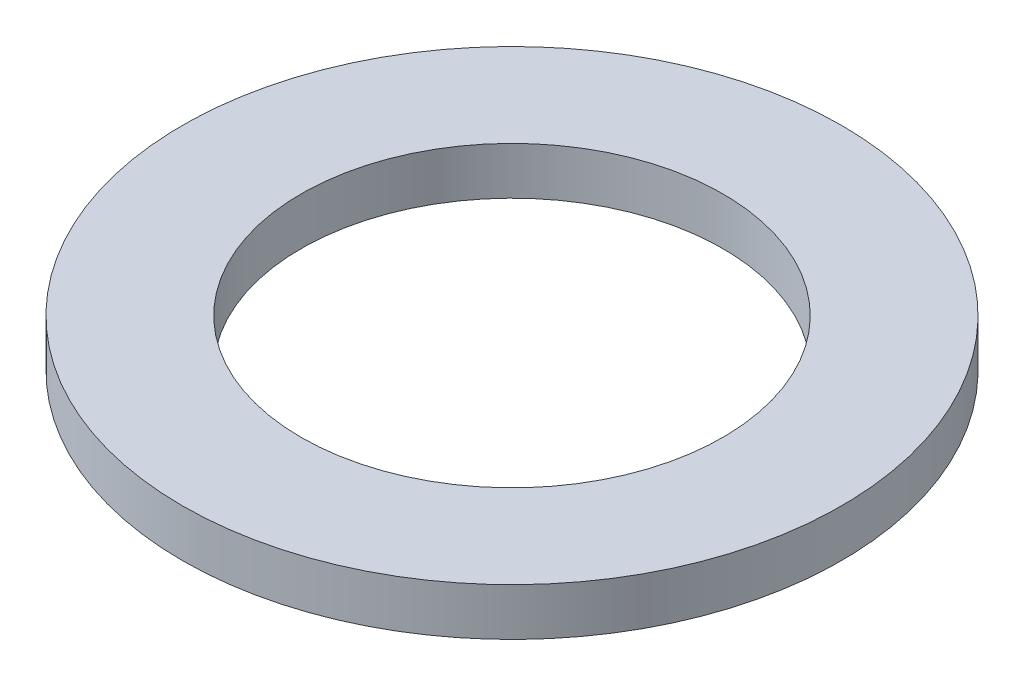
ISO-10303-21;
HEADER;
FILE_DESCRIPTION(('STEP AP214'),'2;1');
FILE_NAME('part.step','',(''),(''),'','','');
FILE_SCHEMA(('AUTOMOTIVE_DESIGN { 1 0 10303 214 1 1 1 1 }'));
ENDSEC;
DATA;
#1=APPLICATION_CONTEXT('core data for automotive mechanical design processes');
#2=APPLICATION_PROTOCOL_DEFINITION('international standard','automotive_design',2000,#1);
#3=PRODUCT_CONTEXT('',#1,'mechanical');
#4=PRODUCT('Part','Part','',(#3));
#5=PRODUCT_RELATED_PRODUCT_CATEGORY('part','',(#4));
#6=PRODUCT_DEFINITION_FORMATION('','',#4);
#7=PRODUCT_DEFINITION_CONTEXT('part definition',#1,'design');
#8=PRODUCT_DEFINITION('design','',#6,#7);
#9=PRODUCT_DEFINITION_SHAPE('','',#8);
#10=(LENGTH_UNIT() NAMED_UNIT(*) SI_UNIT(.MILLI.,.METRE.));
#11=(NAMED_UNIT(*) PLANE_ANGLE_UNIT() SI_UNIT($,.RADIAN.));
#12=(NAMED_UNIT(*) SI_UNIT($,.STERADIAN.) SOLID_ANGLE_UNIT());
#13=UNCERTAINTY_MEASURE_WITH_UNIT(LENGTH_MEASURE(1.E-05),#10,'distance_accuracy_value','');
#14=(GEOMETRIC_REPRESENTATION_CONTEXT(3) GLOBAL_UNCERTAINTY_ASSIGNED_CONTEXT((#13)) GLOBAL_UNIT_ASSIGNED_CONTEXT((#10,
#11,#12)) REPRESENTATION_CONTEXT('',''));
#15=CARTESIAN_POINT('',(0.,0.,0.));
#16=DIRECTION('',(0.,0.,1.));
#17=DIRECTION('',(1.,0.,0.));
#18=AXIS2_PLACEMENT_3D('',#15,#16,#17);
#19=CARTESIAN_POINT('',(0.,9.,0.));
#20=DIRECTION('',(0.,-1.,0.));
#21=DIRECTION('',(0.,0.,-1.));
#22=AXIS2_PLACEMENT_3D('',#19,#20,#21);
#23=CYLINDRICAL_SURFACE('',#22,62.5);
#24=CARTESIAN_POINT('',(0.,9.,0.));
#25=DIRECTION('',(0.,1.,0.));
#26=DIRECTION('',(0.,0.,1.));
#27=AXIS2_PLACEMENT_3D('',#24,#25,#26);
#28=CIRCLE('',#27,62.5);
#29=CARTESIAN_POINT('',(0.,9.,62.5));
#30=VERTEX_POINT('',#29);
#31=EDGE_CURVE('E10',#30,#30,#28,.T.);
#32=ORIENTED_EDGE('',*,*,#31,.F.);
#33=EDGE_LOOP('',(#32));
#34=FACE_BOUND('',#33,.T.);
#35=CARTESIAN_POINT('',(0.,0.,0.));
#36=DIRECTION('',(0.,1.,0.));
#37=DIRECTION('',(0.,0.,1.));
#38=AXIS2_PLACEMENT_3D('',#35,#36,#37);
#39=CIRCLE('',#38,62.5);
#40=CARTESIAN_POINT('',(0.,0.,62.5));
#41=VERTEX_POINT('',#40);
#42=EDGE_CURVE('E37',#41,#41,#39,.T.);
#43=ORIENTED_EDGE('',*,*,#42,.T.);
#44=EDGE_LOOP('',(#43));
#45=FACE_BOUND('',#44,.T.);
#46=ADVANCED_FACE('F40',(#34,#45),#23,.T.);
#47=CARTESIAN_POINT('',(0.,9.,0.));
#48=DIRECTION('',(0.,1.,0.));
#49=DIRECTION('',(0.,0.,1.));
#50=AXIS2_PLACEMENT_3D('',#47,#48,#49);
#51=PLANE('',#50);
#52=CARTESIAN_POINT('',(0.,9.,0.));
#53=DIRECTION('',(0.,1.,0.));
#54=DIRECTION('',(0.,0.,1.));
#55=AXIS2_PLACEMENT_3D('',#52,#53,#54);
#56=CIRCLE('',#55,40.);
#57=CARTESIAN_POINT('',(0.,9.,40.));
#58=VERTEX_POINT('',#57);
#59=EDGE_CURVE('E50',#58,#58,#56,.T.);
#60=ORIENTED_EDGE('',*,*,#59,.F.);
#61=EDGE_LOOP('',(#60));
#62=FACE_BOUND('',#61,.T.);
#63=ORIENTED_EDGE('',*,*,#31,.T.);
#64=EDGE_LOOP('',(#63));
#65=FACE_BOUND('',#64,.T.);
#66=ADVANCED_FACE('F59',(#62,#65),#51,.T.);
#67=CARTESIAN_POINT('',(0.,0.,0.));
#68=DIRECTION('',(0.,1.,0.));
#69=DIRECTION('',(0.,0.,1.));
#70=AXIS2_PLACEMENT_3D('',#67,#68,#69);
#71=PLANE('',#70);
#72=CARTESIAN_POINT('',(0.,0.,0.));
#73=DIRECTION('',(0.,1.,0.));
#74=DIRECTION('',(0.,0.,1.));
#75=AXIS2_PLACEMENT_3D('',#72,#73,#74);
#76=CIRCLE('',#75,40.);
#77=CARTESIAN_POINT('',(0.,0.,40.));
#78=VERTEX_POINT('',#77);
#79=EDGE_CURVE('E47',#78,#78,#76,.T.);
#80=ORIENTED_EDGE('',*,*,#79,.T.);
#81=EDGE_LOOP('',(#80));
#82=FACE_BOUND('',#81,.T.);
#83=ORIENTED_EDGE('',*,*,#42,.F.);
#84=EDGE_LOOP('',(#83));
#85=FACE_BOUND('',#84,.T.);
#86=ADVANCED_FACE('F58',(#82,#85),#71,.F.);
#87=CARTESIAN_POINT('',(0.,9.,0.));
#88=DIRECTION('',(0.,-1.,0.));
#89=DIRECTION('',(0.,0.,-1.));
#90=AXIS2_PLACEMENT_3D('',#87,#88,#89);
#91=CYLINDRICAL_SURFACE('',#90,40.);
#92=ORIENTED_EDGE('',*,*,#59,.T.);
#93=EDGE_LOOP('',(#92));
#94=FACE_BOUND('',#93,.T.);
#95=ORIENTED_EDGE('',*,*,#79,.F.);
#96=EDGE_LOOP('',(#95));
#97=FACE_BOUND('',#96,.T.);
#98=ADVANCED_FACE('F54',(#94,#97),#91,.F.);
#99=CLOSED_SHELL('',(#46,#66,#86,#98));
#100=MANIFOLD_SOLID_BREP('B2',#99);
#101=ADVANCED_BREP_SHAPE_REPRESENTATION('',(#18,#100),#14);
#102=SHAPE_DEFINITION_REPRESENTATION(#9,#101);
ENDSEC;
END-ISO-10303-21;
